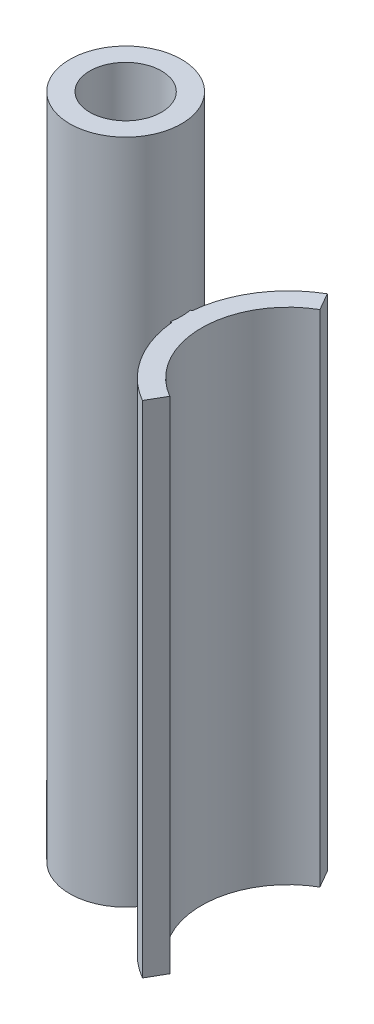
ISO-10303-21;
HEADER;
FILE_DESCRIPTION(('STEP AP214'),'2;1');
FILE_NAME('part.step','',(''),(''),'','','');
FILE_SCHEMA(('AUTOMOTIVE_DESIGN { 1 0 10303 214 1 1 1 1 }'));
ENDSEC;
DATA;
#1=APPLICATION_CONTEXT('core data for automotive mechanical design processes');
#2=APPLICATION_PROTOCOL_DEFINITION('international standard','automotive_design',2000,#1);
#3=PRODUCT_CONTEXT('',#1,'mechanical');
#4=PRODUCT('Part','Part','',(#3));
#5=PRODUCT_RELATED_PRODUCT_CATEGORY('part','',(#4));
#6=PRODUCT_DEFINITION_FORMATION('','',#4);
#7=PRODUCT_DEFINITION_CONTEXT('part definition',#1,'design');
#8=PRODUCT_DEFINITION('design','',#6,#7);
#9=PRODUCT_DEFINITION_SHAPE('','',#8);
#10=(LENGTH_UNIT() NAMED_UNIT(*) SI_UNIT(.MILLI.,.METRE.));
#11=(NAMED_UNIT(*) PLANE_ANGLE_UNIT() SI_UNIT($,.RADIAN.));
#12=(NAMED_UNIT(*) SI_UNIT($,.STERADIAN.) SOLID_ANGLE_UNIT());
#13=UNCERTAINTY_MEASURE_WITH_UNIT(LENGTH_MEASURE(1.E-05),#10,'distance_accuracy_value','');
#14=(GEOMETRIC_REPRESENTATION_CONTEXT(3) GLOBAL_UNCERTAINTY_ASSIGNED_CONTEXT((#13)) GLOBAL_UNIT_ASSIGNED_CONTEXT((#10,
#11,#12)) REPRESENTATION_CONTEXT('',''));
#15=CARTESIAN_POINT('',(0.,0.,0.));
#16=DIRECTION('',(0.,0.,1.));
#17=DIRECTION('',(1.,0.,0.));
#18=AXIS2_PLACEMENT_3D('',#15,#16,#17);
#19=CARTESIAN_POINT('',(0.,100.,0.));
#20=DIRECTION('',(0.,1.,0.));
#21=DIRECTION('',(0.,0.,1.));
#22=AXIS2_PLACEMENT_3D('',#19,#20,#21);
#23=PLANE('',#22);
#24=CARTESIAN_POINT('',(0.,100.,0.));
#25=DIRECTION('',(0.,1.,0.));
#26=DIRECTION('',(0.,0.,1.));
#27=AXIS2_PLACEMENT_3D('',#24,#25,#26);
#28=CIRCLE('',#27,8.375);
#29=CARTESIAN_POINT('',(0.,100.,8.375));
#30=VERTEX_POINT('',#29);
#31=EDGE_CURVE('E11',#30,#30,#28,.T.);
#32=ORIENTED_EDGE('',*,*,#31,.T.);
#33=EDGE_LOOP('',(#32));
#34=FACE_BOUND('',#33,.T.);
#35=CARTESIAN_POINT('',(0.,100.,0.));
#36=DIRECTION('',(0.,1.,0.));
#37=DIRECTION('',(0.,0.,1.));
#38=AXIS2_PLACEMENT_3D('',#35,#36,#37);
#39=CIRCLE('',#38,5.375);
#40=CARTESIAN_POINT('',(0.,100.,5.375));
#41=VERTEX_POINT('',#40);
#42=EDGE_CURVE('E170',#41,#41,#39,.T.);
#43=ORIENTED_EDGE('',*,*,#42,.F.);
#44=EDGE_LOOP('',(#43));
#45=FACE_BOUND('',#44,.T.);
#46=ADVANCED_FACE('F41',(#34,#45),#23,.T.);
#47=CARTESIAN_POINT('',(0.,0.,0.));
#48=DIRECTION('',(0.,1.,0.));
#49=DIRECTION('',(0.,0.,1.));
#50=AXIS2_PLACEMENT_3D('',#47,#48,#49);
#51=PLANE('',#50);
#52=CARTESIAN_POINT('',(0.,0.,0.));
#53=DIRECTION('',(0.,1.,0.));
#54=DIRECTION('',(0.,0.,1.));
#55=AXIS2_PLACEMENT_3D('',#52,#53,#54);
#56=CIRCLE('',#55,8.375);
#57=CARTESIAN_POINT('',(8.2395767488385,0.,-1.5));
#58=VERTEX_POINT('',#57);
#59=CARTESIAN_POINT('',(8.2395767488385,0.,1.5));
#60=VERTEX_POINT('',#59);
#61=EDGE_CURVE('E45',#58,#60,#56,.T.);
#62=ORIENTED_EDGE('',*,*,#61,.F.);
#63=DIRECTION('',(-1.,0.,0.));
#64=VECTOR('',#63,1.);
#65=CARTESIAN_POINT('',(0.,0.,-1.5));
#66=LINE('',#65,#64);
#67=CARTESIAN_POINT('',(8.44546767792601,0.,-1.5));
#68=VERTEX_POINT('',#67);
#69=EDGE_CURVE('E127',#68,#58,#66,.T.);
#70=ORIENTED_EDGE('',*,*,#69,.F.);
#71=CARTESIAN_POINT('',(24.375,0.,0.));
#72=DIRECTION('',(0.,1.,0.));
#73=DIRECTION('',(0.,0.,1.));
#74=AXIS2_PLACEMENT_3D('',#71,#72,#73);
#75=CIRCLE('',#74,16.);
#76=CARTESIAN_POINT('',(16.375,0.,-13.856406460551));
#77=VERTEX_POINT('',#76);
#78=EDGE_CURVE('E152',#77,#68,#75,.T.);
#79=ORIENTED_EDGE('',*,*,#78,.F.);
#80=DIRECTION('',(-0.499999999999998,0.,-0.86602540378444));
#81=VECTOR('',#80,1.);
#82=CARTESIAN_POINT('',(18.28125,0.,-10.5546846086228));
#83=LINE('',#82,#81);
#84=CARTESIAN_POINT('',(17.875,0.,-11.2583302491977));
#85=VERTEX_POINT('',#84);
#86=EDGE_CURVE('E150',#85,#77,#83,.T.);
#87=ORIENTED_EDGE('',*,*,#86,.F.);
#88=CARTESIAN_POINT('',(24.375,0.,0.));
#89=DIRECTION('',(0.,1.,0.));
#90=DIRECTION('',(0.,0.,1.));
#91=AXIS2_PLACEMENT_3D('',#88,#89,#90);
#92=CIRCLE('',#91,13.);
#93=CARTESIAN_POINT('',(17.875,0.,11.2583302491977));
#94=VERTEX_POINT('',#93);
#95=EDGE_CURVE('E147',#85,#94,#92,.T.);
#96=ORIENTED_EDGE('',*,*,#95,.T.);
#97=DIRECTION('',(-0.499999999999998,0.,0.86602540378444));
#98=VECTOR('',#97,1.);
#99=CARTESIAN_POINT('',(18.28125,0.,10.5546846086228));
#100=LINE('',#99,#98);
#101=CARTESIAN_POINT('',(16.375,0.,13.856406460551));
#102=VERTEX_POINT('',#101);
#103=EDGE_CURVE('E144',#94,#102,#100,.T.);
#104=ORIENTED_EDGE('',*,*,#103,.T.);
#105=CARTESIAN_POINT('',(24.375,0.,0.));
#106=DIRECTION('',(0.,1.,0.));
#107=DIRECTION('',(0.,0.,1.));
#108=AXIS2_PLACEMENT_3D('',#105,#106,#107);
#109=CIRCLE('',#108,16.);
#110=CARTESIAN_POINT('',(8.44546767792601,0.,1.5));
#111=VERTEX_POINT('',#110);
#112=EDGE_CURVE('E142',#111,#102,#109,.T.);
#113=ORIENTED_EDGE('',*,*,#112,.F.);
#114=DIRECTION('',(-1.,0.,0.));
#115=VECTOR('',#114,1.);
#116=CARTESIAN_POINT('',(0.,0.,1.5));
#117=LINE('',#116,#115);
#118=EDGE_CURVE('E111',#111,#60,#117,.T.);
#119=ORIENTED_EDGE('',*,*,#118,.T.);
#120=EDGE_LOOP('',(#62,#70,#79,#87,#96,#104,#113,#119));
#121=FACE_BOUND('',#120,.T.);
#122=CARTESIAN_POINT('',(0.,0.,0.));
#123=DIRECTION('',(0.,1.,0.));
#124=DIRECTION('',(0.,0.,1.));
#125=AXIS2_PLACEMENT_3D('',#122,#123,#124);
#126=CIRCLE('',#125,5.375);
#127=CARTESIAN_POINT('',(0.,0.,5.375));
#128=VERTEX_POINT('',#127);
#129=EDGE_CURVE('E169',#128,#128,#126,.T.);
#130=ORIENTED_EDGE('',*,*,#129,.T.);
#131=EDGE_LOOP('',(#130));
#132=FACE_BOUND('',#131,.T.);
#133=ADVANCED_FACE('F176',(#121,#132),#51,.F.);
#134=CARTESIAN_POINT('',(0.,100.,0.));
#135=DIRECTION('',(0.,-1.,0.));
#136=DIRECTION('',(0.,0.,-1.));
#137=AXIS2_PLACEMENT_3D('',#134,#135,#136);
#138=CYLINDRICAL_SURFACE('',#137,8.375);
#139=ORIENTED_EDGE('',*,*,#31,.F.);
#140=EDGE_LOOP('',(#139));
#141=FACE_BOUND('',#140,.T.);
#142=ORIENTED_EDGE('',*,*,#61,.T.);
#143=DIRECTION('',(0.,-1.,0.));
#144=VECTOR('',#143,1.);
#145=CARTESIAN_POINT('',(8.2395767488385,75.,1.5));
#146=LINE('',#145,#144);
#147=CARTESIAN_POINT('',(8.2395767488385,75.,1.5));
#148=VERTEX_POINT('',#147);
#149=EDGE_CURVE('E61',#148,#60,#146,.T.);
#150=ORIENTED_EDGE('',*,*,#149,.F.);
#151=CARTESIAN_POINT('',(0.,75.,0.));
#152=DIRECTION('',(0.,1.,0.));
#153=DIRECTION('',(0.,0.,1.));
#154=AXIS2_PLACEMENT_3D('',#151,#152,#153);
#155=CIRCLE('',#154,8.375);
#156=CARTESIAN_POINT('',(8.2395767488385,75.,-1.5));
#157=VERTEX_POINT('',#156);
#158=EDGE_CURVE('E56',#148,#157,#155,.T.);
#159=ORIENTED_EDGE('',*,*,#158,.T.);
#160=DIRECTION('',(0.,-1.,0.));
#161=VECTOR('',#160,1.);
#162=CARTESIAN_POINT('',(8.2395767488385,75.,-1.5));
#163=LINE('',#162,#161);
#164=EDGE_CURVE('E140',#157,#58,#163,.T.);
#165=ORIENTED_EDGE('',*,*,#164,.T.);
#166=EDGE_LOOP('',(#142,#150,#159,#165));
#167=FACE_BOUND('',#166,.T.);
#168=ADVANCED_FACE('F43',(#141,#167),#138,.T.);
#169=CARTESIAN_POINT('',(0.,100.,0.));
#170=DIRECTION('',(0.,-1.,0.));
#171=DIRECTION('',(0.,0.,-1.));
#172=AXIS2_PLACEMENT_3D('',#169,#170,#171);
#173=CYLINDRICAL_SURFACE('',#172,5.375);
#174=ORIENTED_EDGE('',*,*,#42,.T.);
#175=EDGE_LOOP('',(#174));
#176=FACE_BOUND('',#175,.T.);
#177=ORIENTED_EDGE('',*,*,#129,.F.);
#178=EDGE_LOOP('',(#177));
#179=FACE_BOUND('',#178,.T.);
#180=ADVANCED_FACE('F178',(#176,#179),#173,.F.);
#181=CARTESIAN_POINT('',(0.,75.,1.5));
#182=DIRECTION('',(0.,0.,1.));
#183=DIRECTION('',(1.,0.,0.));
#184=AXIS2_PLACEMENT_3D('',#181,#182,#183);
#185=PLANE('',#184);
#186=ORIENTED_EDGE('',*,*,#118,.F.);
#187=DIRECTION('',(0.,-1.,0.));
#188=VECTOR('',#187,1.);
#189=CARTESIAN_POINT('',(8.44546767792601,75.,1.5));
#190=LINE('',#189,#188);
#191=CARTESIAN_POINT('',(8.44546767792601,75.,1.5));
#192=VERTEX_POINT('',#191);
#193=EDGE_CURVE('E105',#192,#111,#190,.T.);
#194=ORIENTED_EDGE('',*,*,#193,.F.);
#195=DIRECTION('',(-1.,0.,0.));
#196=VECTOR('',#195,1.);
#197=CARTESIAN_POINT('',(0.,75.,1.5));
#198=LINE('',#197,#196);
#199=EDGE_CURVE('E109',#192,#148,#198,.T.);
#200=ORIENTED_EDGE('',*,*,#199,.T.);
#201=ORIENTED_EDGE('',*,*,#149,.T.);
#202=EDGE_LOOP('',(#186,#194,#200,#201));
#203=FACE_BOUND('',#202,.T.);
#204=ADVANCED_FACE('F107',(#203),#185,.T.);
#205=CARTESIAN_POINT('',(24.375,75.,0.));
#206=DIRECTION('',(0.,-1.,0.));
#207=DIRECTION('',(0.,0.,-1.));
#208=AXIS2_PLACEMENT_3D('',#205,#206,#207);
#209=CYLINDRICAL_SURFACE('',#208,16.);
#210=ORIENTED_EDGE('',*,*,#112,.T.);
#211=DIRECTION('',(0.,-1.,0.));
#212=VECTOR('',#211,1.);
#213=CARTESIAN_POINT('',(16.375,75.,13.856406460551));
#214=LINE('',#213,#212);
#215=CARTESIAN_POINT('',(16.375,75.,13.856406460551));
#216=VERTEX_POINT('',#215);
#217=EDGE_CURVE('E115',#216,#102,#214,.T.);
#218=ORIENTED_EDGE('',*,*,#217,.F.);
#219=CARTESIAN_POINT('',(24.375,75.,0.));
#220=DIRECTION('',(0.,1.,0.));
#221=DIRECTION('',(0.,0.,1.));
#222=AXIS2_PLACEMENT_3D('',#219,#220,#221);
#223=CIRCLE('',#222,16.);
#224=EDGE_CURVE('E118',#192,#216,#223,.T.);
#225=ORIENTED_EDGE('',*,*,#224,.F.);
#226=ORIENTED_EDGE('',*,*,#193,.T.);
#227=EDGE_LOOP('',(#210,#218,#225,#226));
#228=FACE_BOUND('',#227,.T.);
#229=ADVANCED_FACE('F119',(#228),#209,.T.);
#230=CARTESIAN_POINT('',(18.28125,75.,10.5546846086228));
#231=DIRECTION('',(0.86602540378444,0.,0.499999999999998));
#232=DIRECTION('',(0.499999999999998,0.,-0.86602540378444));
#233=AXIS2_PLACEMENT_3D('',#230,#231,#232);
#234=PLANE('',#233);
#235=ORIENTED_EDGE('',*,*,#103,.F.);
#236=DIRECTION('',(0.,-1.,0.));
#237=VECTOR('',#236,1.);
#238=CARTESIAN_POINT('',(17.875,75.,11.2583302491977));
#239=LINE('',#238,#237);
#240=CARTESIAN_POINT('',(17.875,75.,11.2583302491977));
#241=VERTEX_POINT('',#240);
#242=EDGE_CURVE('E165',#241,#94,#239,.T.);
#243=ORIENTED_EDGE('',*,*,#242,.F.);
#244=DIRECTION('',(-0.499999999999998,0.,0.86602540378444));
#245=VECTOR('',#244,1.);
#246=CARTESIAN_POINT('',(18.28125,75.,10.5546846086228));
#247=LINE('',#246,#245);
#248=EDGE_CURVE('E123',#241,#216,#247,.T.);
#249=ORIENTED_EDGE('',*,*,#248,.T.);
#250=ORIENTED_EDGE('',*,*,#217,.T.);
#251=EDGE_LOOP('',(#235,#243,#249,#250));
#252=FACE_BOUND('',#251,.T.);
#253=ADVANCED_FACE('F204',(#252),#234,.T.);
#254=CARTESIAN_POINT('',(24.375,75.,0.));
#255=DIRECTION('',(0.,-1.,0.));
#256=DIRECTION('',(0.,0.,-1.));
#257=AXIS2_PLACEMENT_3D('',#254,#255,#256);
#258=CYLINDRICAL_SURFACE('',#257,13.);
#259=ORIENTED_EDGE('',*,*,#95,.F.);
#260=DIRECTION('',(0.,-1.,0.));
#261=VECTOR('',#260,1.);
#262=CARTESIAN_POINT('',(17.875,75.,-11.2583302491977));
#263=LINE('',#262,#261);
#264=CARTESIAN_POINT('',(17.875,75.,-11.2583302491977));
#265=VERTEX_POINT('',#264);
#266=EDGE_CURVE('E163',#265,#85,#263,.T.);
#267=ORIENTED_EDGE('',*,*,#266,.F.);
#268=CARTESIAN_POINT('',(24.375,75.,0.));
#269=DIRECTION('',(0.,1.,0.));
#270=DIRECTION('',(0.,0.,1.));
#271=AXIS2_PLACEMENT_3D('',#268,#269,#270);
#272=CIRCLE('',#271,13.);
#273=EDGE_CURVE('E131',#265,#241,#272,.T.);
#274=ORIENTED_EDGE('',*,*,#273,.T.);
#275=ORIENTED_EDGE('',*,*,#242,.T.);
#276=EDGE_LOOP('',(#259,#267,#274,#275));
#277=FACE_BOUND('',#276,.T.);
#278=ADVANCED_FACE('F207',(#277),#258,.F.);
#279=CARTESIAN_POINT('',(18.28125,75.,-10.5546846086228));
#280=DIRECTION('',(-0.86602540378444,0.,0.499999999999998));
#281=DIRECTION('',(0.499999999999998,0.,0.86602540378444));
#282=AXIS2_PLACEMENT_3D('',#279,#280,#281);
#283=PLANE('',#282);
#284=ORIENTED_EDGE('',*,*,#86,.T.);
#285=DIRECTION('',(0.,-1.,0.));
#286=VECTOR('',#285,1.);
#287=CARTESIAN_POINT('',(16.375,75.,-13.856406460551));
#288=LINE('',#287,#286);
#289=CARTESIAN_POINT('',(16.375,75.,-13.856406460551));
#290=VERTEX_POINT('',#289);
#291=EDGE_CURVE('E160',#290,#77,#288,.T.);
#292=ORIENTED_EDGE('',*,*,#291,.F.);
#293=DIRECTION('',(-0.499999999999998,0.,-0.86602540378444));
#294=VECTOR('',#293,1.);
#295=CARTESIAN_POINT('',(18.28125,75.,-10.5546846086228));
#296=LINE('',#295,#294);
#297=EDGE_CURVE('E134',#265,#290,#296,.T.);
#298=ORIENTED_EDGE('',*,*,#297,.F.);
#299=ORIENTED_EDGE('',*,*,#266,.T.);
#300=EDGE_LOOP('',(#284,#292,#298,#299));
#301=FACE_BOUND('',#300,.T.);
#302=ADVANCED_FACE('F211',(#301),#283,.F.);
#303=CARTESIAN_POINT('',(24.375,75.,0.));
#304=DIRECTION('',(0.,-1.,0.));
#305=DIRECTION('',(0.,0.,-1.));
#306=AXIS2_PLACEMENT_3D('',#303,#304,#305);
#307=CYLINDRICAL_SURFACE('',#306,16.);
#308=ORIENTED_EDGE('',*,*,#78,.T.);
#309=DIRECTION('',(0.,-1.,0.));
#310=VECTOR('',#309,1.);
#311=CARTESIAN_POINT('',(8.44546767792601,75.,-1.5));
#312=LINE('',#311,#310);
#313=CARTESIAN_POINT('',(8.44546767792601,75.,-1.5));
#314=VERTEX_POINT('',#313);
#315=EDGE_CURVE('E157',#314,#68,#312,.T.);
#316=ORIENTED_EDGE('',*,*,#315,.F.);
#317=CARTESIAN_POINT('',(24.375,75.,0.));
#318=DIRECTION('',(0.,1.,0.));
#319=DIRECTION('',(0.,0.,1.));
#320=AXIS2_PLACEMENT_3D('',#317,#318,#319);
#321=CIRCLE('',#320,16.);
#322=EDGE_CURVE('E136',#290,#314,#321,.T.);
#323=ORIENTED_EDGE('',*,*,#322,.F.);
#324=ORIENTED_EDGE('',*,*,#291,.T.);
#325=EDGE_LOOP('',(#308,#316,#323,#324));
#326=FACE_BOUND('',#325,.T.);
#327=ADVANCED_FACE('F216',(#326),#307,.T.);
#328=CARTESIAN_POINT('',(0.,75.,-1.5));
#329=DIRECTION('',(0.,0.,1.));
#330=DIRECTION('',(1.,0.,0.));
#331=AXIS2_PLACEMENT_3D('',#328,#329,#330);
#332=PLANE('',#331);
#333=ORIENTED_EDGE('',*,*,#69,.T.);
#334=ORIENTED_EDGE('',*,*,#164,.F.);
#335=DIRECTION('',(-1.,0.,0.));
#336=VECTOR('',#335,1.);
#337=CARTESIAN_POINT('',(0.,75.,-1.5));
#338=LINE('',#337,#336);
#339=EDGE_CURVE('E138',#314,#157,#338,.T.);
#340=ORIENTED_EDGE('',*,*,#339,.F.);
#341=ORIENTED_EDGE('',*,*,#315,.T.);
#342=EDGE_LOOP('',(#333,#334,#340,#341));
#343=FACE_BOUND('',#342,.T.);
#344=ADVANCED_FACE('F219',(#343),#332,.F.);
#345=CARTESIAN_POINT('',(0.,75.,0.));
#346=DIRECTION('',(0.,1.,0.));
#347=DIRECTION('',(0.,0.,1.));
#348=AXIS2_PLACEMENT_3D('',#345,#346,#347);
#349=PLANE('',#348);
#350=ORIENTED_EDGE('',*,*,#158,.F.);
#351=ORIENTED_EDGE('',*,*,#199,.F.);
#352=ORIENTED_EDGE('',*,*,#224,.T.);
#353=ORIENTED_EDGE('',*,*,#248,.F.);
#354=ORIENTED_EDGE('',*,*,#273,.F.);
#355=ORIENTED_EDGE('',*,*,#297,.T.);
#356=ORIENTED_EDGE('',*,*,#322,.T.);
#357=ORIENTED_EDGE('',*,*,#339,.T.);
#358=EDGE_LOOP('',(#350,#351,#352,#353,#354,#355,#356,#357));
#359=FACE_BOUND('',#358,.T.);
#360=ADVANCED_FACE('F125',(#359),#349,.T.);
#361=CLOSED_SHELL('',(#46,#133,#168,#180,#204,#229,#253,#278,#302,#327,#344,#360));
#362=MANIFOLD_SOLID_BREP('B2',#361);
#363=ADVANCED_BREP_SHAPE_REPRESENTATION('',(#18,#362),#14);
#364=SHAPE_DEFINITION_REPRESENTATION(#9,#363);
ENDSEC;
END-ISO-10303-21;
